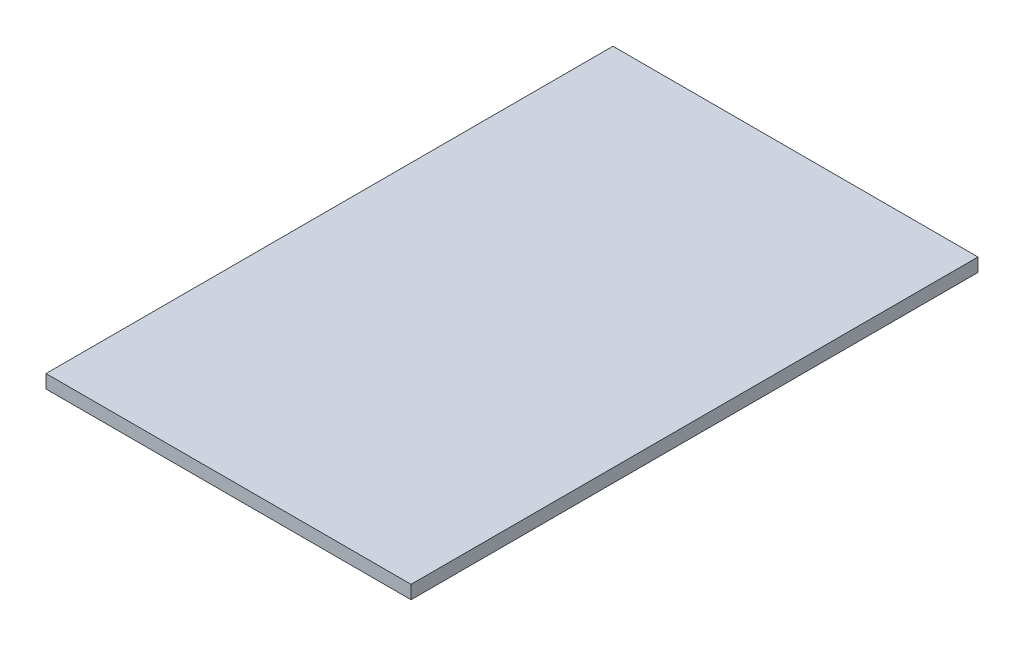
ISO-10303-21;
HEADER;
FILE_DESCRIPTION(('STEP AP214'),'2;1');
FILE_NAME('part.step','',(''),(''),'','','');
FILE_SCHEMA(('AUTOMOTIVE_DESIGN { 1 0 10303 214 1 1 1 1 }'));
ENDSEC;
DATA;
#1=APPLICATION_CONTEXT('core data for automotive mechanical design processes');
#2=APPLICATION_PROTOCOL_DEFINITION('international standard','automotive_design',2000,#1);
#3=PRODUCT_CONTEXT('',#1,'mechanical');
#4=PRODUCT('Part','Part','',(#3));
#5=PRODUCT_RELATED_PRODUCT_CATEGORY('part','',(#4));
#6=PRODUCT_DEFINITION_FORMATION('','',#4);
#7=PRODUCT_DEFINITION_CONTEXT('part definition',#1,'design');
#8=PRODUCT_DEFINITION('design','',#6,#7);
#9=PRODUCT_DEFINITION_SHAPE('','',#8);
#10=(LENGTH_UNIT() NAMED_UNIT(*) SI_UNIT(.MILLI.,.METRE.));
#11=(NAMED_UNIT(*) PLANE_ANGLE_UNIT() SI_UNIT($,.RADIAN.));
#12=(NAMED_UNIT(*) SI_UNIT($,.STERADIAN.) SOLID_ANGLE_UNIT());
#13=UNCERTAINTY_MEASURE_WITH_UNIT(LENGTH_MEASURE(1.E-05),#10,'distance_accuracy_value','');
#14=(GEOMETRIC_REPRESENTATION_CONTEXT(3) GLOBAL_UNCERTAINTY_ASSIGNED_CONTEXT((#13)) GLOBAL_UNIT_ASSIGNED_CONTEXT((#10,
#11,#12)) REPRESENTATION_CONTEXT('',''));
#15=CARTESIAN_POINT('',(0.,0.,0.));
#16=DIRECTION('',(0.,0.,1.));
#17=DIRECTION('',(1.,0.,0.));
#18=AXIS2_PLACEMENT_3D('',#15,#16,#17);
#19=CARTESIAN_POINT('',(-245.,18.,380.5));
#20=DIRECTION('',(1.,0.,0.));
#21=DIRECTION('',(0.,0.,-1.));
#22=AXIS2_PLACEMENT_3D('',#19,#20,#21);
#23=PLANE('',#22);
#24=DIRECTION('',(0.,0.,1.));
#25=VECTOR('',#24,1.);
#26=CARTESIAN_POINT('',(-245.,0.,380.5));
#27=LINE('',#26,#25);
#28=CARTESIAN_POINT('',(-245.,0.,-380.5));
#29=VERTEX_POINT('',#28);
#30=CARTESIAN_POINT('',(-245.,0.,380.5));
#31=VERTEX_POINT('',#30);
#32=EDGE_CURVE('E98',#29,#31,#27,.T.);
#33=ORIENTED_EDGE('',*,*,#32,.T.);
#34=DIRECTION('',(0.,-1.,0.));
#35=VECTOR('',#34,1.);
#36=CARTESIAN_POINT('',(-245.,18.,380.5));
#37=LINE('',#36,#35);
#38=CARTESIAN_POINT('',(-245.,18.,380.5));
#39=VERTEX_POINT('',#38);
#40=EDGE_CURVE('E11',#39,#31,#37,.T.);
#41=ORIENTED_EDGE('',*,*,#40,.F.);
#42=DIRECTION('',(0.,0.,1.));
#43=VECTOR('',#42,1.);
#44=CARTESIAN_POINT('',(-245.,18.,380.5));
#45=LINE('',#44,#43);
#46=CARTESIAN_POINT('',(-245.,18.,-380.5));
#47=VERTEX_POINT('',#46);
#48=EDGE_CURVE('E86',#47,#39,#45,.T.);
#49=ORIENTED_EDGE('',*,*,#48,.F.);
#50=DIRECTION('',(0.,-1.,0.));
#51=VECTOR('',#50,1.);
#52=CARTESIAN_POINT('',(-245.,18.,-380.5));
#53=LINE('',#52,#51);
#54=EDGE_CURVE('E94',#47,#29,#53,.T.);
#55=ORIENTED_EDGE('',*,*,#54,.T.);
#56=EDGE_LOOP('',(#33,#41,#49,#55));
#57=FACE_BOUND('',#56,.T.);
#58=ADVANCED_FACE('F35',(#57),#23,.F.);
#59=CARTESIAN_POINT('',(245.,18.,380.5));
#60=DIRECTION('',(0.,0.,-1.));
#61=DIRECTION('',(-1.,0.,0.));
#62=AXIS2_PLACEMENT_3D('',#59,#60,#61);
#63=PLANE('',#62);
#64=DIRECTION('',(1.,0.,0.));
#65=VECTOR('',#64,1.);
#66=CARTESIAN_POINT('',(245.,0.,380.5));
#67=LINE('',#66,#65);
#68=CARTESIAN_POINT('',(245.,0.,380.5));
#69=VERTEX_POINT('',#68);
#70=EDGE_CURVE('E90',#31,#69,#67,.T.);
#71=ORIENTED_EDGE('',*,*,#70,.T.);
#72=DIRECTION('',(0.,-1.,0.));
#73=VECTOR('',#72,1.);
#74=CARTESIAN_POINT('',(245.,18.,380.5));
#75=LINE('',#74,#73);
#76=CARTESIAN_POINT('',(245.,18.,380.5));
#77=VERTEX_POINT('',#76);
#78=EDGE_CURVE('E43',#77,#69,#75,.T.);
#79=ORIENTED_EDGE('',*,*,#78,.F.);
#80=DIRECTION('',(1.,0.,0.));
#81=VECTOR('',#80,1.);
#82=CARTESIAN_POINT('',(245.,18.,380.5));
#83=LINE('',#82,#81);
#84=EDGE_CURVE('E81',#39,#77,#83,.T.);
#85=ORIENTED_EDGE('',*,*,#84,.F.);
#86=ORIENTED_EDGE('',*,*,#40,.T.);
#87=EDGE_LOOP('',(#71,#79,#85,#86));
#88=FACE_BOUND('',#87,.T.);
#89=ADVANCED_FACE('F89',(#88),#63,.F.);
#90=CARTESIAN_POINT('',(245.,18.,380.5));
#91=DIRECTION('',(-1.,0.,0.));
#92=DIRECTION('',(0.,0.,1.));
#93=AXIS2_PLACEMENT_3D('',#90,#91,#92);
#94=PLANE('',#93);
#95=DIRECTION('',(0.,0.,-1.));
#96=VECTOR('',#95,1.);
#97=CARTESIAN_POINT('',(245.,0.,380.5));
#98=LINE('',#97,#96);
#99=CARTESIAN_POINT('',(245.,0.,-380.5));
#100=VERTEX_POINT('',#99);
#101=EDGE_CURVE('E68',#69,#100,#98,.T.);
#102=ORIENTED_EDGE('',*,*,#101,.T.);
#103=DIRECTION('',(0.,-1.,0.));
#104=VECTOR('',#103,1.);
#105=CARTESIAN_POINT('',(245.,18.,-380.5));
#106=LINE('',#105,#104);
#107=CARTESIAN_POINT('',(245.,18.,-380.5));
#108=VERTEX_POINT('',#107);
#109=EDGE_CURVE('E91',#108,#100,#106,.T.);
#110=ORIENTED_EDGE('',*,*,#109,.F.);
#111=DIRECTION('',(0.,0.,-1.));
#112=VECTOR('',#111,1.);
#113=CARTESIAN_POINT('',(245.,18.,380.5));
#114=LINE('',#113,#112);
#115=EDGE_CURVE('E84',#77,#108,#114,.T.);
#116=ORIENTED_EDGE('',*,*,#115,.F.);
#117=ORIENTED_EDGE('',*,*,#78,.T.);
#118=EDGE_LOOP('',(#102,#110,#116,#117));
#119=FACE_BOUND('',#118,.T.);
#120=ADVANCED_FACE('F92',(#119),#94,.F.);
#121=CARTESIAN_POINT('',(245.,18.,-380.5));
#122=DIRECTION('',(0.,0.,1.));
#123=DIRECTION('',(1.,0.,0.));
#124=AXIS2_PLACEMENT_3D('',#121,#122,#123);
#125=PLANE('',#124);
#126=DIRECTION('',(-1.,0.,0.));
#127=VECTOR('',#126,1.);
#128=CARTESIAN_POINT('',(245.,0.,-380.5));
#129=LINE('',#128,#127);
#130=EDGE_CURVE('E74',#100,#29,#129,.T.);
#131=ORIENTED_EDGE('',*,*,#130,.T.);
#132=ORIENTED_EDGE('',*,*,#54,.F.);
#133=DIRECTION('',(-1.,0.,0.));
#134=VECTOR('',#133,1.);
#135=CARTESIAN_POINT('',(245.,18.,-380.5));
#136=LINE('',#135,#134);
#137=EDGE_CURVE('E51',#108,#47,#136,.T.);
#138=ORIENTED_EDGE('',*,*,#137,.F.);
#139=ORIENTED_EDGE('',*,*,#109,.T.);
#140=EDGE_LOOP('',(#131,#132,#138,#139));
#141=FACE_BOUND('',#140,.T.);
#142=ADVANCED_FACE('F105',(#141),#125,.F.);
#143=CARTESIAN_POINT('',(0.,18.,0.));
#144=DIRECTION('',(0.,1.,0.));
#145=DIRECTION('',(0.,0.,1.));
#146=AXIS2_PLACEMENT_3D('',#143,#144,#145);
#147=PLANE('',#146);
#148=ORIENTED_EDGE('',*,*,#48,.T.);
#149=ORIENTED_EDGE('',*,*,#84,.T.);
#150=ORIENTED_EDGE('',*,*,#115,.T.);
#151=ORIENTED_EDGE('',*,*,#137,.T.);
#152=EDGE_LOOP('',(#148,#149,#150,#151));
#153=FACE_BOUND('',#152,.T.);
#154=ADVANCED_FACE('F82',(#153),#147,.T.);
#155=CARTESIAN_POINT('',(0.,0.,0.));
#156=DIRECTION('',(0.,1.,0.));
#157=DIRECTION('',(0.,0.,1.));
#158=AXIS2_PLACEMENT_3D('',#155,#156,#157);
#159=PLANE('',#158);
#160=ORIENTED_EDGE('',*,*,#32,.F.);
#161=ORIENTED_EDGE('',*,*,#130,.F.);
#162=ORIENTED_EDGE('',*,*,#101,.F.);
#163=ORIENTED_EDGE('',*,*,#70,.F.);
#164=EDGE_LOOP('',(#160,#161,#162,#163));
#165=FACE_BOUND('',#164,.T.);
#166=ADVANCED_FACE('F108',(#165),#159,.F.);
#167=CLOSED_SHELL('',(#58,#89,#120,#142,#154,#166));
#168=MANIFOLD_SOLID_BREP('B2',#167);
#169=ADVANCED_BREP_SHAPE_REPRESENTATION('',(#18,#168),#14);
#170=SHAPE_DEFINITION_REPRESENTATION(#9,#169);
ENDSEC;
END-ISO-10303-21;
